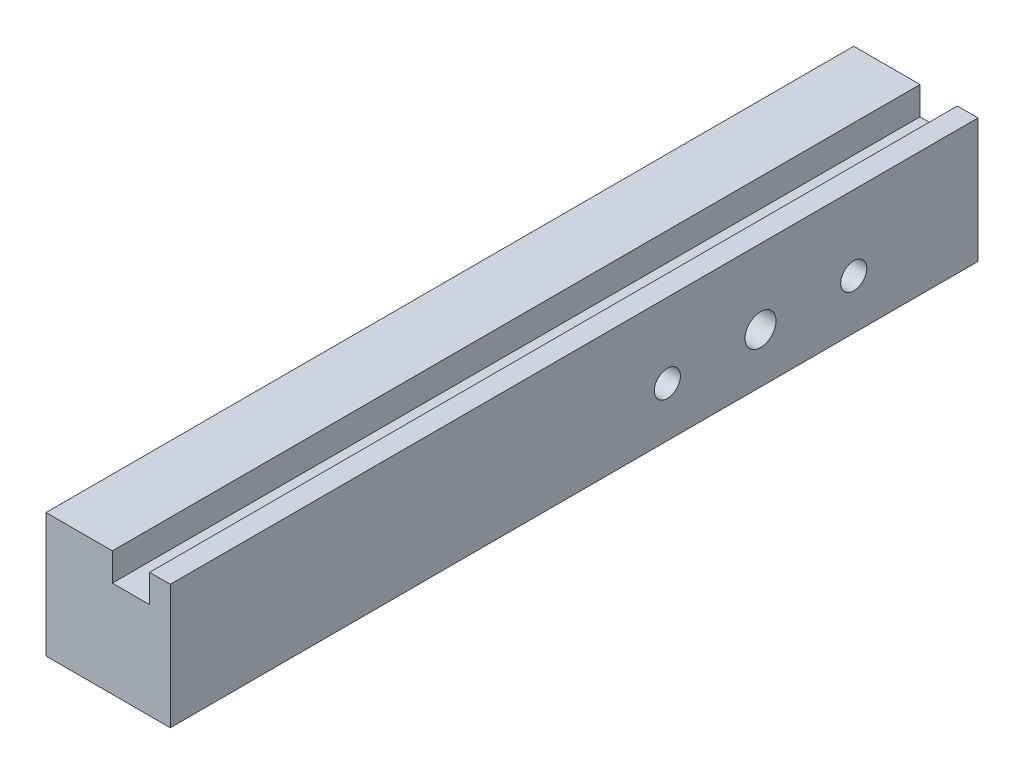
ISO-10303-21;
HEADER;
FILE_DESCRIPTION(('STEP AP214'),'2;1');
FILE_NAME('part.step','',(''),(''),'','','');
FILE_SCHEMA(('AUTOMOTIVE_DESIGN { 1 0 10303 214 1 1 1 1 }'));
ENDSEC;
DATA;
#1=APPLICATION_CONTEXT('core data for automotive mechanical design processes');
#2=APPLICATION_PROTOCOL_DEFINITION('international standard','automotive_design',2000,#1);
#3=PRODUCT_CONTEXT('',#1,'mechanical');
#4=PRODUCT('Part','Part','',(#3));
#5=PRODUCT_RELATED_PRODUCT_CATEGORY('part','',(#4));
#6=PRODUCT_DEFINITION_FORMATION('','',#4);
#7=PRODUCT_DEFINITION_CONTEXT('part definition',#1,'design');
#8=PRODUCT_DEFINITION('design','',#6,#7);
#9=PRODUCT_DEFINITION_SHAPE('','',#8);
#10=(LENGTH_UNIT() NAMED_UNIT(*) SI_UNIT(.MILLI.,.METRE.));
#11=(NAMED_UNIT(*) PLANE_ANGLE_UNIT() SI_UNIT($,.RADIAN.));
#12=(NAMED_UNIT(*) SI_UNIT($,.STERADIAN.) SOLID_ANGLE_UNIT());
#13=UNCERTAINTY_MEASURE_WITH_UNIT(LENGTH_MEASURE(1.E-05),#10,'distance_accuracy_value','');
#14=(GEOMETRIC_REPRESENTATION_CONTEXT(3) GLOBAL_UNCERTAINTY_ASSIGNED_CONTEXT((#13)) GLOBAL_UNIT_ASSIGNED_CONTEXT((#10,
#11,#12)) REPRESENTATION_CONTEXT('',''));
#15=CARTESIAN_POINT('',(0.,0.,0.));
#16=DIRECTION('',(0.,0.,1.));
#17=DIRECTION('',(1.,0.,0.));
#18=AXIS2_PLACEMENT_3D('',#15,#16,#17);
#19=CARTESIAN_POINT('',(0.,20.,130.));
#20=DIRECTION('',(0.,-1.,0.));
#21=DIRECTION('',(0.,0.,-1.));
#22=AXIS2_PLACEMENT_3D('',#19,#20,#21);
#23=PLANE('',#22);
#24=DIRECTION('',(-1.,0.,0.));
#25=VECTOR('',#24,1.);
#26=CARTESIAN_POINT('',(0.,20.,130.));
#27=LINE('',#26,#25);
#28=CARTESIAN_POINT('',(10.675361054723,20.,130.));
#29=VERTEX_POINT('',#28);
#30=CARTESIAN_POINT('',(0.,20.,130.));
#31=VERTEX_POINT('',#30);
#32=EDGE_CURVE('E61',#29,#31,#27,.T.);
#33=ORIENTED_EDGE('',*,*,#32,.F.);
#34=DIRECTION('',(0.,0.,1.));
#35=VECTOR('',#34,1.);
#36=CARTESIAN_POINT('',(10.675361054723,20.,0.));
#37=LINE('',#36,#35);
#38=CARTESIAN_POINT('',(10.675361054723,20.,0.));
#39=VERTEX_POINT('',#38);
#40=EDGE_CURVE('E115',#39,#29,#37,.T.);
#41=ORIENTED_EDGE('',*,*,#40,.F.);
#42=DIRECTION('',(-1.,0.,0.));
#43=VECTOR('',#42,1.);
#44=CARTESIAN_POINT('',(0.,20.,0.));
#45=LINE('',#44,#43);
#46=CARTESIAN_POINT('',(0.,20.,0.));
#47=VERTEX_POINT('',#46);
#48=EDGE_CURVE('E83',#39,#47,#45,.T.);
#49=ORIENTED_EDGE('',*,*,#48,.T.);
#50=DIRECTION('',(0.,0.,-1.));
#51=VECTOR('',#50,1.);
#52=CARTESIAN_POINT('',(0.,20.,130.));
#53=LINE('',#52,#51);
#54=EDGE_CURVE('E152',#31,#47,#53,.T.);
#55=ORIENTED_EDGE('',*,*,#54,.F.);
#56=EDGE_LOOP('',(#33,#41,#49,#55));
#57=FACE_BOUND('',#56,.T.);
#58=ADVANCED_FACE('F37',(#57),#23,.F.);
#59=CARTESIAN_POINT('',(0.,0.,130.));
#60=DIRECTION('',(1.,0.,0.));
#61=DIRECTION('',(0.,1.,0.));
#62=AXIS2_PLACEMENT_3D('',#59,#60,#61);
#63=PLANE('',#62);
#64=CARTESIAN_POINT('',(0.,7.99999999999999,34.9999999999996));
#65=DIRECTION('',(1.,0.,0.));
#66=DIRECTION('',(0.,1.,0.));
#67=AXIS2_PLACEMENT_3D('',#64,#65,#66);
#68=CIRCLE('',#67,2.5);
#69=CARTESIAN_POINT('',(0.,10.5,34.9999999999996));
#70=VERTEX_POINT('',#69);
#71=EDGE_CURVE('E230',#70,#70,#68,.T.);
#72=ORIENTED_EDGE('',*,*,#71,.T.);
#73=EDGE_LOOP('',(#72));
#74=FACE_BOUND('',#73,.T.);
#75=CARTESIAN_POINT('',(0.,8.,20.));
#76=DIRECTION('',(-1.,0.,0.));
#77=DIRECTION('',(0.,0.,1.));
#78=AXIS2_PLACEMENT_3D('',#75,#76,#77);
#79=CIRCLE('',#78,2.1);
#80=CARTESIAN_POINT('',(0.,8.,22.1));
#81=VERTEX_POINT('',#80);
#82=EDGE_CURVE('E235',#81,#81,#79,.T.);
#83=ORIENTED_EDGE('',*,*,#82,.F.);
#84=EDGE_LOOP('',(#83));
#85=FACE_BOUND('',#84,.T.);
#86=CARTESIAN_POINT('',(0.,8.,50.));
#87=DIRECTION('',(-1.,0.,0.));
#88=DIRECTION('',(0.,0.,1.));
#89=AXIS2_PLACEMENT_3D('',#86,#87,#88);
#90=CIRCLE('',#89,2.1);
#91=CARTESIAN_POINT('',(0.,8.,52.1));
#92=VERTEX_POINT('',#91);
#93=EDGE_CURVE('E243',#92,#92,#90,.T.);
#94=ORIENTED_EDGE('',*,*,#93,.F.);
#95=EDGE_LOOP('',(#94));
#96=FACE_BOUND('',#95,.T.);
#97=DIRECTION('',(0.,-1.,0.));
#98=VECTOR('',#97,1.);
#99=CARTESIAN_POINT('',(0.,0.,0.));
#100=LINE('',#99,#98);
#101=CARTESIAN_POINT('',(0.,0.,0.));
#102=VERTEX_POINT('',#101);
#103=EDGE_CURVE('E139',#47,#102,#100,.T.);
#104=ORIENTED_EDGE('',*,*,#103,.T.);
#105=DIRECTION('',(0.,0.,-1.));
#106=VECTOR('',#105,1.);
#107=CARTESIAN_POINT('',(0.,0.,130.));
#108=LINE('',#107,#106);
#109=CARTESIAN_POINT('',(0.,0.,130.));
#110=VERTEX_POINT('',#109);
#111=EDGE_CURVE('E11',#110,#102,#108,.T.);
#112=ORIENTED_EDGE('',*,*,#111,.F.);
#113=DIRECTION('',(0.,-1.,0.));
#114=VECTOR('',#113,1.);
#115=CARTESIAN_POINT('',(0.,0.,130.));
#116=LINE('',#115,#114);
#117=EDGE_CURVE('E144',#31,#110,#116,.T.);
#118=ORIENTED_EDGE('',*,*,#117,.F.);
#119=ORIENTED_EDGE('',*,*,#54,.T.);
#120=EDGE_LOOP('',(#104,#112,#118,#119));
#121=FACE_BOUND('',#120,.T.);
#122=ADVANCED_FACE('F39',(#74,#85,#96,#121),#63,.F.);
#123=CARTESIAN_POINT('',(0.,0.,130.));
#124=DIRECTION('',(0.,1.,0.));
#125=DIRECTION('',(0.,0.,1.));
#126=AXIS2_PLACEMENT_3D('',#123,#124,#125);
#127=PLANE('',#126);
#128=DIRECTION('',(1.,0.,0.));
#129=VECTOR('',#128,1.);
#130=CARTESIAN_POINT('',(0.,0.,0.));
#131=LINE('',#130,#129);
#132=CARTESIAN_POINT('',(20.,0.,0.));
#133=VERTEX_POINT('',#132);
#134=EDGE_CURVE('E155',#102,#133,#131,.T.);
#135=ORIENTED_EDGE('',*,*,#134,.T.);
#136=DIRECTION('',(0.,0.,-1.));
#137=VECTOR('',#136,1.);
#138=CARTESIAN_POINT('',(20.,0.,130.));
#139=LINE('',#138,#137);
#140=CARTESIAN_POINT('',(20.,0.,130.));
#141=VERTEX_POINT('',#140);
#142=EDGE_CURVE('E45',#141,#133,#139,.T.);
#143=ORIENTED_EDGE('',*,*,#142,.F.);
#144=DIRECTION('',(1.,0.,0.));
#145=VECTOR('',#144,1.);
#146=CARTESIAN_POINT('',(0.,0.,130.));
#147=LINE('',#146,#145);
#148=EDGE_CURVE('E90',#110,#141,#147,.T.);
#149=ORIENTED_EDGE('',*,*,#148,.F.);
#150=ORIENTED_EDGE('',*,*,#111,.T.);
#151=EDGE_LOOP('',(#135,#143,#149,#150));
#152=FACE_BOUND('',#151,.T.);
#153=ADVANCED_FACE('F181',(#152),#127,.F.);
#154=CARTESIAN_POINT('',(20.,0.,130.));
#155=DIRECTION('',(-1.,0.,0.));
#156=DIRECTION('',(0.,-1.,0.));
#157=AXIS2_PLACEMENT_3D('',#154,#155,#156);
#158=PLANE('',#157);
#159=CARTESIAN_POINT('',(20.,7.99999999999999,34.9999999999996));
#160=DIRECTION('',(1.,0.,0.));
#161=DIRECTION('',(0.,1.,0.));
#162=AXIS2_PLACEMENT_3D('',#159,#160,#161);
#163=CIRCLE('',#162,2.5);
#164=CARTESIAN_POINT('',(20.,10.5,34.9999999999996));
#165=VERTEX_POINT('',#164);
#166=EDGE_CURVE('E233',#165,#165,#163,.T.);
#167=ORIENTED_EDGE('',*,*,#166,.F.);
#168=EDGE_LOOP('',(#167));
#169=FACE_BOUND('',#168,.T.);
#170=CARTESIAN_POINT('',(20.,8.,20.));
#171=DIRECTION('',(-1.,0.,0.));
#172=DIRECTION('',(0.,0.,1.));
#173=AXIS2_PLACEMENT_3D('',#170,#171,#172);
#174=CIRCLE('',#173,2.1);
#175=CARTESIAN_POINT('',(20.,8.,22.1));
#176=VERTEX_POINT('',#175);
#177=EDGE_CURVE('E240',#176,#176,#174,.T.);
#178=ORIENTED_EDGE('',*,*,#177,.T.);
#179=EDGE_LOOP('',(#178));
#180=FACE_BOUND('',#179,.T.);
#181=CARTESIAN_POINT('',(20.,8.,50.));
#182=DIRECTION('',(-1.,0.,0.));
#183=DIRECTION('',(0.,0.,1.));
#184=AXIS2_PLACEMENT_3D('',#181,#182,#183);
#185=CIRCLE('',#184,2.1);
#186=CARTESIAN_POINT('',(20.,8.,52.1));
#187=VERTEX_POINT('',#186);
#188=EDGE_CURVE('E135',#187,#187,#185,.T.);
#189=ORIENTED_EDGE('',*,*,#188,.T.);
#190=EDGE_LOOP('',(#189));
#191=FACE_BOUND('',#190,.T.);
#192=DIRECTION('',(0.,1.,0.));
#193=VECTOR('',#192,1.);
#194=CARTESIAN_POINT('',(20.,0.,0.));
#195=LINE('',#194,#193);
#196=CARTESIAN_POINT('',(20.,20.,0.));
#197=VERTEX_POINT('',#196);
#198=EDGE_CURVE('E157',#133,#197,#195,.T.);
#199=ORIENTED_EDGE('',*,*,#198,.T.);
#200=DIRECTION('',(0.,0.,-1.));
#201=VECTOR('',#200,1.);
#202=CARTESIAN_POINT('',(20.,20.,130.));
#203=LINE('',#202,#201);
#204=CARTESIAN_POINT('',(20.,20.,130.));
#205=VERTEX_POINT('',#204);
#206=EDGE_CURVE('E162',#205,#197,#203,.T.);
#207=ORIENTED_EDGE('',*,*,#206,.F.);
#208=DIRECTION('',(0.,1.,0.));
#209=VECTOR('',#208,1.);
#210=CARTESIAN_POINT('',(20.,0.,130.));
#211=LINE('',#210,#209);
#212=EDGE_CURVE('E148',#141,#205,#211,.T.);
#213=ORIENTED_EDGE('',*,*,#212,.F.);
#214=ORIENTED_EDGE('',*,*,#142,.T.);
#215=EDGE_LOOP('',(#199,#207,#213,#214));
#216=FACE_BOUND('',#215,.T.);
#217=ADVANCED_FACE('F168',(#169,#180,#191,#216),#158,.F.);
#218=CARTESIAN_POINT('',(16.6715605697334,20.,0.));
#219=VERTEX_POINT('',#218);
#220=EDGE_CURVE('E146',#197,#219,#45,.T.);
#221=ORIENTED_EDGE('',*,*,#220,.T.);
#222=DIRECTION('',(0.,0.,-1.));
#223=VECTOR('',#222,1.);
#224=CARTESIAN_POINT('',(16.6715605697334,20.,0.));
#225=LINE('',#224,#223);
#226=CARTESIAN_POINT('',(16.6715605697334,20.,130.));
#227=VERTEX_POINT('',#226);
#228=EDGE_CURVE('E125',#227,#219,#225,.T.);
#229=ORIENTED_EDGE('',*,*,#228,.F.);
#230=EDGE_CURVE('E150',#205,#227,#27,.T.);
#231=ORIENTED_EDGE('',*,*,#230,.F.);
#232=ORIENTED_EDGE('',*,*,#206,.T.);
#233=EDGE_LOOP('',(#221,#229,#231,#232));
#234=FACE_BOUND('',#233,.T.);
#235=ADVANCED_FACE('F176',(#234),#23,.F.);
#236=CARTESIAN_POINT('',(0.,0.,130.));
#237=DIRECTION('',(0.,0.,-1.));
#238=DIRECTION('',(-1.,0.,0.));
#239=AXIS2_PLACEMENT_3D('',#236,#237,#238);
#240=PLANE('',#239);
#241=DIRECTION('',(1.,0.,0.));
#242=VECTOR('',#241,1.);
#243=CARTESIAN_POINT('',(10.675361054723,15.5,130.));
#244=LINE('',#243,#242);
#245=CARTESIAN_POINT('',(10.675361054723,15.5,130.));
#246=VERTEX_POINT('',#245);
#247=CARTESIAN_POINT('',(16.6715605697334,15.5,130.));
#248=VERTEX_POINT('',#247);
#249=EDGE_CURVE('E121',#246,#248,#244,.T.);
#250=ORIENTED_EDGE('',*,*,#249,.F.);
#251=DIRECTION('',(0.,1.,0.));
#252=VECTOR('',#251,1.);
#253=CARTESIAN_POINT('',(10.675361054723,15.5,130.));
#254=LINE('',#253,#252);
#255=EDGE_CURVE('E111',#246,#29,#254,.T.);
#256=ORIENTED_EDGE('',*,*,#255,.T.);
#257=ORIENTED_EDGE('',*,*,#32,.T.);
#258=ORIENTED_EDGE('',*,*,#117,.T.);
#259=ORIENTED_EDGE('',*,*,#148,.T.);
#260=ORIENTED_EDGE('',*,*,#212,.T.);
#261=ORIENTED_EDGE('',*,*,#230,.T.);
#262=DIRECTION('',(0.,1.,0.));
#263=VECTOR('',#262,1.);
#264=CARTESIAN_POINT('',(16.6715605697334,15.5,130.));
#265=LINE('',#264,#263);
#266=EDGE_CURVE('E117',#248,#227,#265,.T.);
#267=ORIENTED_EDGE('',*,*,#266,.F.);
#268=EDGE_LOOP('',(#250,#256,#257,#258,#259,#260,#261,#267));
#269=FACE_BOUND('',#268,.T.);
#270=ADVANCED_FACE('F127',(#269),#240,.F.);
#271=CARTESIAN_POINT('',(0.,0.,0.));
#272=DIRECTION('',(0.,0.,-1.));
#273=DIRECTION('',(-1.,0.,0.));
#274=AXIS2_PLACEMENT_3D('',#271,#272,#273);
#275=PLANE('',#274);
#276=DIRECTION('',(0.,1.,0.));
#277=VECTOR('',#276,1.);
#278=CARTESIAN_POINT('',(10.675361054723,15.5,0.));
#279=LINE('',#278,#277);
#280=CARTESIAN_POINT('',(10.675361054723,15.5,0.));
#281=VERTEX_POINT('',#280);
#282=EDGE_CURVE('E137',#281,#39,#279,.T.);
#283=ORIENTED_EDGE('',*,*,#282,.F.);
#284=DIRECTION('',(-1.,0.,0.));
#285=VECTOR('',#284,1.);
#286=CARTESIAN_POINT('',(10.675361054723,15.5,0.));
#287=LINE('',#286,#285);
#288=CARTESIAN_POINT('',(16.6715605697334,15.5,0.));
#289=VERTEX_POINT('',#288);
#290=EDGE_CURVE('E118',#289,#281,#287,.T.);
#291=ORIENTED_EDGE('',*,*,#290,.F.);
#292=DIRECTION('',(0.,1.,0.));
#293=VECTOR('',#292,1.);
#294=CARTESIAN_POINT('',(16.6715605697334,15.5,0.));
#295=LINE('',#294,#293);
#296=EDGE_CURVE('E140',#289,#219,#295,.T.);
#297=ORIENTED_EDGE('',*,*,#296,.T.);
#298=ORIENTED_EDGE('',*,*,#220,.F.);
#299=ORIENTED_EDGE('',*,*,#198,.F.);
#300=ORIENTED_EDGE('',*,*,#134,.F.);
#301=ORIENTED_EDGE('',*,*,#103,.F.);
#302=ORIENTED_EDGE('',*,*,#48,.F.);
#303=EDGE_LOOP('',(#283,#291,#297,#298,#299,#300,#301,#302));
#304=FACE_BOUND('',#303,.T.);
#305=ADVANCED_FACE('F172',(#304),#275,.T.);
#306=CARTESIAN_POINT('',(10.675361054723,15.5,0.));
#307=DIRECTION('',(-1.,0.,0.));
#308=DIRECTION('',(0.,0.,1.));
#309=AXIS2_PLACEMENT_3D('',#306,#307,#308);
#310=PLANE('',#309);
#311=ORIENTED_EDGE('',*,*,#40,.T.);
#312=ORIENTED_EDGE('',*,*,#255,.F.);
#313=DIRECTION('',(0.,0.,1.));
#314=VECTOR('',#313,1.);
#315=CARTESIAN_POINT('',(10.675361054723,15.5,0.));
#316=LINE('',#315,#314);
#317=EDGE_CURVE('E114',#281,#246,#316,.T.);
#318=ORIENTED_EDGE('',*,*,#317,.F.);
#319=ORIENTED_EDGE('',*,*,#282,.T.);
#320=EDGE_LOOP('',(#311,#312,#318,#319));
#321=FACE_BOUND('',#320,.T.);
#322=ADVANCED_FACE('F113',(#321),#310,.F.);
#323=CARTESIAN_POINT('',(16.6715605697334,15.5,0.));
#324=DIRECTION('',(1.,0.,0.));
#325=DIRECTION('',(0.,0.,-1.));
#326=AXIS2_PLACEMENT_3D('',#323,#324,#325);
#327=PLANE('',#326);
#328=ORIENTED_EDGE('',*,*,#228,.T.);
#329=ORIENTED_EDGE('',*,*,#296,.F.);
#330=DIRECTION('',(0.,0.,-1.));
#331=VECTOR('',#330,1.);
#332=CARTESIAN_POINT('',(16.6715605697334,15.5,0.));
#333=LINE('',#332,#331);
#334=EDGE_CURVE('E52',#248,#289,#333,.T.);
#335=ORIENTED_EDGE('',*,*,#334,.F.);
#336=ORIENTED_EDGE('',*,*,#266,.T.);
#337=EDGE_LOOP('',(#328,#329,#335,#336));
#338=FACE_BOUND('',#337,.T.);
#339=ADVANCED_FACE('F208',(#338),#327,.F.);
#340=CARTESIAN_POINT('',(0.,15.5,0.));
#341=DIRECTION('',(0.,1.,0.));
#342=DIRECTION('',(0.,0.,1.));
#343=AXIS2_PLACEMENT_3D('',#340,#341,#342);
#344=PLANE('',#343);
#345=ORIENTED_EDGE('',*,*,#317,.T.);
#346=ORIENTED_EDGE('',*,*,#249,.T.);
#347=ORIENTED_EDGE('',*,*,#334,.T.);
#348=ORIENTED_EDGE('',*,*,#290,.T.);
#349=EDGE_LOOP('',(#345,#346,#347,#348));
#350=FACE_BOUND('',#349,.T.);
#351=ADVANCED_FACE('F120',(#350),#344,.T.);
#352=CARTESIAN_POINT('',(0.,8.,50.));
#353=DIRECTION('',(-1.,0.,0.));
#354=DIRECTION('',(0.,0.,1.));
#355=AXIS2_PLACEMENT_3D('',#352,#353,#354);
#356=CYLINDRICAL_SURFACE('',#355,2.1);
#357=ORIENTED_EDGE('',*,*,#188,.F.);
#358=EDGE_LOOP('',(#357));
#359=FACE_BOUND('',#358,.T.);
#360=ORIENTED_EDGE('',*,*,#93,.T.);
#361=EDGE_LOOP('',(#360));
#362=FACE_BOUND('',#361,.T.);
#363=ADVANCED_FACE('F214',(#359,#362),#356,.F.);
#364=CARTESIAN_POINT('',(0.,8.,20.));
#365=DIRECTION('',(-1.,0.,0.));
#366=DIRECTION('',(0.,0.,1.));
#367=AXIS2_PLACEMENT_3D('',#364,#365,#366);
#368=CYLINDRICAL_SURFACE('',#367,2.1);
#369=ORIENTED_EDGE('',*,*,#177,.F.);
#370=EDGE_LOOP('',(#369));
#371=FACE_BOUND('',#370,.T.);
#372=ORIENTED_EDGE('',*,*,#82,.T.);
#373=EDGE_LOOP('',(#372));
#374=FACE_BOUND('',#373,.T.);
#375=ADVANCED_FACE('F217',(#371,#374),#368,.F.);
#376=CARTESIAN_POINT('',(0.,7.99999999999999,34.9999999999996));
#377=DIRECTION('',(1.,0.,0.));
#378=DIRECTION('',(0.,1.,0.));
#379=AXIS2_PLACEMENT_3D('',#376,#377,#378);
#380=CYLINDRICAL_SURFACE('',#379,2.5);
#381=ORIENTED_EDGE('',*,*,#71,.F.);
#382=EDGE_LOOP('',(#381));
#383=FACE_BOUND('',#382,.T.);
#384=ORIENTED_EDGE('',*,*,#166,.T.);
#385=EDGE_LOOP('',(#384));
#386=FACE_BOUND('',#385,.T.);
#387=ADVANCED_FACE('F221',(#383,#386),#380,.F.);
#388=CLOSED_SHELL('',(#58,#122,#153,#217,#235,#270,#305,#322,#339,#351,#363,#375,#387));
#389=MANIFOLD_SOLID_BREP('B2',#388);
#390=ADVANCED_BREP_SHAPE_REPRESENTATION('',(#18,#389),#14);
#391=SHAPE_DEFINITION_REPRESENTATION(#9,#390);
ENDSEC;
END-ISO-10303-21;
